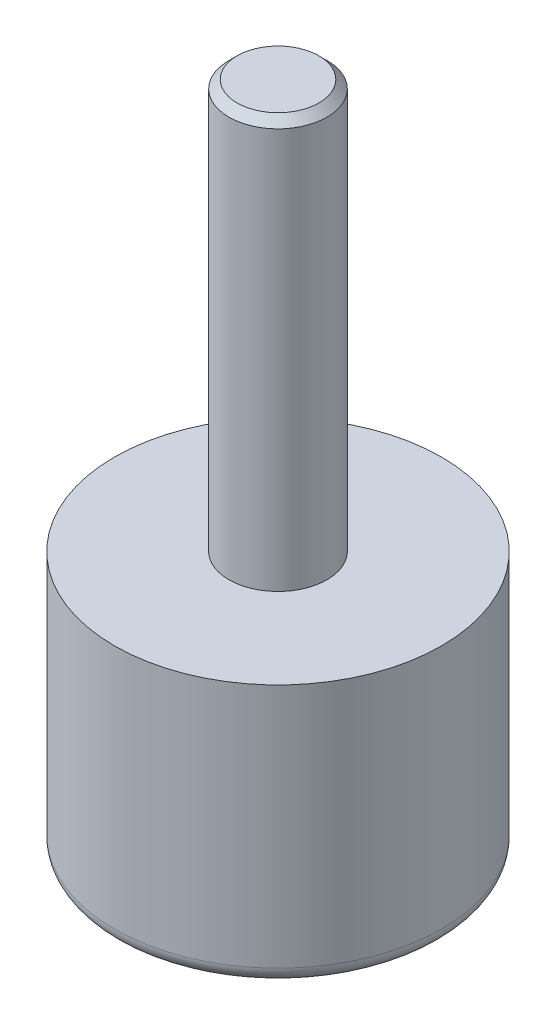
ISO-10303-21;
HEADER;
FILE_DESCRIPTION(('STEP AP214'),'2;1');
FILE_NAME('part.step','',(''),(''),'','','');
FILE_SCHEMA(('AUTOMOTIVE_DESIGN { 1 0 10303 214 1 1 1 1 }'));
ENDSEC;
DATA;
#1=APPLICATION_CONTEXT('core data for automotive mechanical design processes');
#2=APPLICATION_PROTOCOL_DEFINITION('international standard','automotive_design',2000,#1);
#3=PRODUCT_CONTEXT('',#1,'mechanical');
#4=PRODUCT('Part','Part','',(#3));
#5=PRODUCT_RELATED_PRODUCT_CATEGORY('part','',(#4));
#6=PRODUCT_DEFINITION_FORMATION('','',#4);
#7=PRODUCT_DEFINITION_CONTEXT('part definition',#1,'design');
#8=PRODUCT_DEFINITION('design','',#6,#7);
#9=PRODUCT_DEFINITION_SHAPE('','',#8);
#10=(LENGTH_UNIT() NAMED_UNIT(*) SI_UNIT(.MILLI.,.METRE.));
#11=(NAMED_UNIT(*) PLANE_ANGLE_UNIT() SI_UNIT($,.RADIAN.));
#12=(NAMED_UNIT(*) SI_UNIT($,.STERADIAN.) SOLID_ANGLE_UNIT());
#13=UNCERTAINTY_MEASURE_WITH_UNIT(LENGTH_MEASURE(1.E-05),#10,'distance_accuracy_value','');
#14=(GEOMETRIC_REPRESENTATION_CONTEXT(3) GLOBAL_UNCERTAINTY_ASSIGNED_CONTEXT((#13)) GLOBAL_UNIT_ASSIGNED_CONTEXT((#10,
#11,#12)) REPRESENTATION_CONTEXT('',''));
#15=CARTESIAN_POINT('',(0.,0.,0.));
#16=DIRECTION('',(0.,0.,1.));
#17=DIRECTION('',(1.,0.,0.));
#18=AXIS2_PLACEMENT_3D('',#15,#16,#17);
#19=CARTESIAN_POINT('',(0.,-16.25,0.));
#20=DIRECTION('',(0.,1.,0.));
#21=DIRECTION('',(-1.,0.,0.));
#22=AXIS2_PLACEMENT_3D('',#19,#20,#21);
#23=SPHERICAL_SURFACE('',#22,6.25);
#24=CARTESIAN_POINT('',(0.,-18.5,0.));
#25=DIRECTION('',(0.,1.,0.));
#26=DIRECTION('',(0.,0.,1.));
#27=AXIS2_PLACEMENT_3D('',#24,#25,#26);
#28=CIRCLE('',#27,5.8309518948453);
#29=CARTESIAN_POINT('',(0.,-18.5,5.8309518948453));
#30=VERTEX_POINT('',#29);
#31=EDGE_CURVE('E52',#30,#30,#28,.T.);
#32=ORIENTED_EDGE('',*,*,#31,.F.);
#33=EDGE_LOOP('',(#32));
#34=FACE_BOUND('',#33,.T.);
#35=ADVANCED_FACE('F32',(#34),#23,.T.);
#36=CARTESIAN_POINT('',(-5.8309518948453,-18.5,0.));
#37=DIRECTION('',(0.,-1.,0.));
#38=DIRECTION('',(0.,0.,-1.));
#39=AXIS2_PLACEMENT_3D('',#36,#37,#38);
#40=PLANE('',#39);
#41=CARTESIAN_POINT('',(0.,-18.5,0.));
#42=DIRECTION('',(0.,-1.,0.));
#43=DIRECTION('',(0.,0.,-1.));
#44=AXIS2_PLACEMENT_3D('',#41,#42,#43);
#45=CIRCLE('',#44,9.);
#46=CARTESIAN_POINT('',(0.,-18.5,-9.));
#47=VERTEX_POINT('',#46);
#48=EDGE_CURVE('E10',#47,#47,#45,.T.);
#49=ORIENTED_EDGE('',*,*,#48,.T.);
#50=EDGE_LOOP('',(#49));
#51=FACE_BOUND('',#50,.T.);
#52=ORIENTED_EDGE('',*,*,#31,.T.);
#53=EDGE_LOOP('',(#52));
#54=FACE_BOUND('',#53,.T.);
#55=ADVANCED_FACE('F76',(#51,#54),#40,.T.);
#56=CARTESIAN_POINT('',(0.,22.5,0.));
#57=DIRECTION('',(0.,1.,0.));
#58=DIRECTION('',(0.,0.,1.));
#59=AXIS2_PLACEMENT_3D('',#56,#57,#58);
#60=CYLINDRICAL_SURFACE('',#59,10.);
#61=CARTESIAN_POINT('',(0.,-17.5,0.));
#62=DIRECTION('',(0.,-1.,0.));
#63=DIRECTION('',(0.,0.,-1.));
#64=AXIS2_PLACEMENT_3D('',#61,#62,#63);
#65=CIRCLE('',#64,10.);
#66=CARTESIAN_POINT('',(0.,-17.5,-10.));
#67=VERTEX_POINT('',#66);
#68=EDGE_CURVE('E39',#67,#67,#65,.F.);
#69=ORIENTED_EDGE('',*,*,#68,.T.);
#70=EDGE_LOOP('',(#69));
#71=FACE_BOUND('',#70,.T.);
#72=CARTESIAN_POINT('',(0.,-2.5,0.));
#73=DIRECTION('',(0.,1.,0.));
#74=DIRECTION('',(0.,0.,1.));
#75=AXIS2_PLACEMENT_3D('',#72,#73,#74);
#76=CIRCLE('',#75,10.);
#77=CARTESIAN_POINT('',(0.,-2.5,10.));
#78=VERTEX_POINT('',#77);
#79=EDGE_CURVE('E55',#78,#78,#76,.T.);
#80=ORIENTED_EDGE('',*,*,#79,.F.);
#81=EDGE_LOOP('',(#80));
#82=FACE_BOUND('',#81,.T.);
#83=ADVANCED_FACE('F66',(#71,#82),#60,.T.);
#84=CARTESIAN_POINT('',(-9.99999999999999,-2.5,0.));
#85=DIRECTION('',(0.,1.,0.));
#86=DIRECTION('',(0.,0.,1.));
#87=AXIS2_PLACEMENT_3D('',#84,#85,#86);
#88=PLANE('',#87);
#89=ORIENTED_EDGE('',*,*,#79,.T.);
#90=EDGE_LOOP('',(#89));
#91=FACE_BOUND('',#90,.T.);
#92=CARTESIAN_POINT('',(0.,-2.5,0.));
#93=DIRECTION('',(0.,1.,0.));
#94=DIRECTION('',(0.,0.,1.));
#95=AXIS2_PLACEMENT_3D('',#92,#93,#94);
#96=CIRCLE('',#95,3.);
#97=CARTESIAN_POINT('',(0.,-2.5,3.));
#98=VERTEX_POINT('',#97);
#99=EDGE_CURVE('E58',#98,#98,#96,.T.);
#100=ORIENTED_EDGE('',*,*,#99,.F.);
#101=EDGE_LOOP('',(#100));
#102=FACE_BOUND('',#101,.T.);
#103=ADVANCED_FACE('F64',(#91,#102),#88,.T.);
#104=CARTESIAN_POINT('',(0.,22.5,0.));
#105=DIRECTION('',(0.,1.,0.));
#106=DIRECTION('',(0.,0.,1.));
#107=AXIS2_PLACEMENT_3D('',#104,#105,#106);
#108=CYLINDRICAL_SURFACE('',#107,3.);
#109=CARTESIAN_POINT('',(0.,22.,0.));
#110=DIRECTION('',(0.,1.,0.));
#111=DIRECTION('',(0.,0.,1.));
#112=AXIS2_PLACEMENT_3D('',#109,#110,#111);
#113=CIRCLE('',#112,3.);
#114=CARTESIAN_POINT('',(0.,22.,3.));
#115=VERTEX_POINT('',#114);
#116=EDGE_CURVE('E43',#115,#115,#113,.F.);
#117=ORIENTED_EDGE('',*,*,#116,.T.);
#118=EDGE_LOOP('',(#117));
#119=FACE_BOUND('',#118,.T.);
#120=ORIENTED_EDGE('',*,*,#99,.T.);
#121=EDGE_LOOP('',(#120));
#122=FACE_BOUND('',#121,.T.);
#123=ADVANCED_FACE('F62',(#119,#122),#108,.T.);
#124=CARTESIAN_POINT('',(-3.,22.5,0.));
#125=DIRECTION('',(0.,1.,0.));
#126=DIRECTION('',(0.,0.,1.));
#127=AXIS2_PLACEMENT_3D('',#124,#125,#126);
#128=PLANE('',#127);
#129=CARTESIAN_POINT('',(0.,22.5,0.));
#130=DIRECTION('',(0.,1.,0.));
#131=DIRECTION('',(0.,0.,1.));
#132=AXIS2_PLACEMENT_3D('',#129,#130,#131);
#133=CIRCLE('',#132,2.50000000000001);
#134=CARTESIAN_POINT('',(0.,22.5,2.50000000000001));
#135=VERTEX_POINT('',#134);
#136=EDGE_CURVE('E47',#135,#135,#133,.T.);
#137=ORIENTED_EDGE('',*,*,#136,.T.);
#138=EDGE_LOOP('',(#137));
#139=FACE_BOUND('',#138,.T.);
#140=ADVANCED_FACE('F73',(#139),#128,.T.);
#141=CARTESIAN_POINT('',(0.,22.5,0.));
#142=DIRECTION('',(0.,-1.,0.));
#143=DIRECTION('',(0.,0.,-1.));
#144=AXIS2_PLACEMENT_3D('',#141,#142,#143);
#145=CONICAL_SURFACE('',#144,2.50000000000001,0.785398163397446);
#146=ORIENTED_EDGE('',*,*,#116,.F.);
#147=EDGE_LOOP('',(#146));
#148=FACE_BOUND('',#147,.T.);
#149=ORIENTED_EDGE('',*,*,#136,.F.);
#150=EDGE_LOOP('',(#149));
#151=FACE_BOUND('',#150,.T.);
#152=ADVANCED_FACE('F86',(#148,#151),#145,.T.);
#153=CARTESIAN_POINT('',(0.,-17.5,0.));
#154=DIRECTION('',(0.,-1.,0.));
#155=DIRECTION('',(0.,0.,-1.));
#156=AXIS2_PLACEMENT_3D('',#153,#154,#155);
#157=TOROIDAL_SURFACE('',#156,9.,1.);
#158=ORIENTED_EDGE('',*,*,#48,.F.);
#159=EDGE_LOOP('',(#158));
#160=FACE_BOUND('',#159,.T.);
#161=ORIENTED_EDGE('',*,*,#68,.F.);
#162=EDGE_LOOP('',(#161));
#163=FACE_BOUND('',#162,.T.);
#164=ADVANCED_FACE('F34',(#160,#163),#157,.T.);
#165=CLOSED_SHELL('',(#35,#55,#83,#103,#123,#140,#152,#164));
#166=MANIFOLD_SOLID_BREP('B2',#165);
#167=ADVANCED_BREP_SHAPE_REPRESENTATION('',(#18,#166),#14);
#168=SHAPE_DEFINITION_REPRESENTATION(#9,#167);
ENDSEC;
END-ISO-10303-21;
